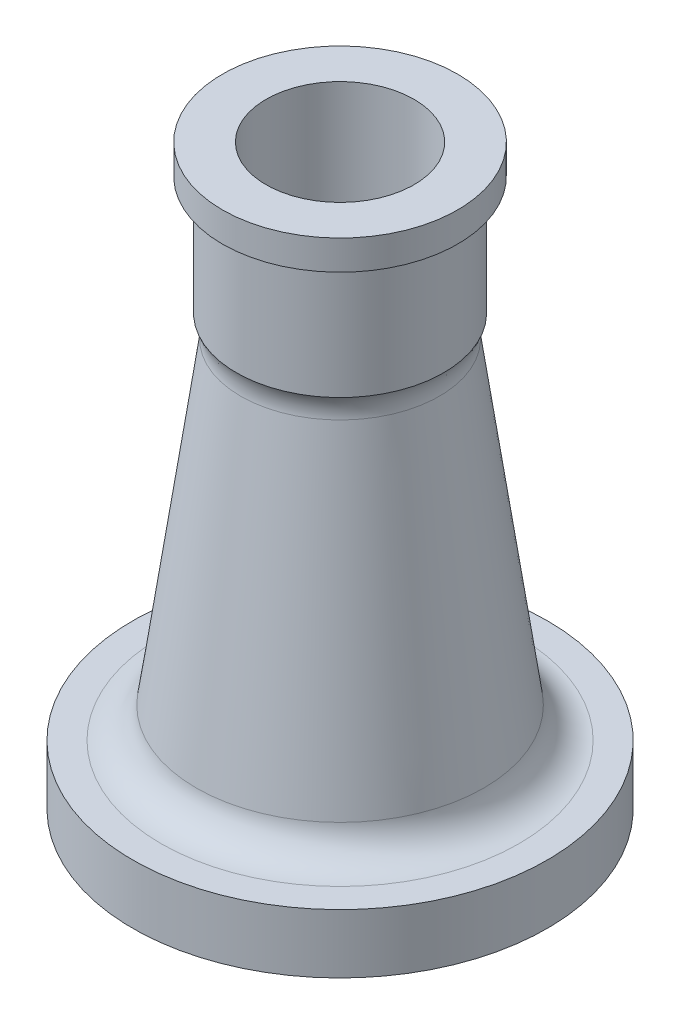
ISO-10303-21;
HEADER;
FILE_DESCRIPTION(('STEP AP214'),'2;1');
FILE_NAME('part.step','',(''),(''),'','','');
FILE_SCHEMA(('AUTOMOTIVE_DESIGN { 1 0 10303 214 1 1 1 1 }'));
ENDSEC;
DATA;
#1=APPLICATION_CONTEXT('core data for automotive mechanical design processes');
#2=APPLICATION_PROTOCOL_DEFINITION('international standard','automotive_design',2000,#1);
#3=PRODUCT_CONTEXT('',#1,'mechanical');
#4=PRODUCT('Part','Part','',(#3));
#5=PRODUCT_RELATED_PRODUCT_CATEGORY('part','',(#4));
#6=PRODUCT_DEFINITION_FORMATION('','',#4);
#7=PRODUCT_DEFINITION_CONTEXT('part definition',#1,'design');
#8=PRODUCT_DEFINITION('design','',#6,#7);
#9=PRODUCT_DEFINITION_SHAPE('','',#8);
#10=(LENGTH_UNIT() NAMED_UNIT(*) SI_UNIT(.MILLI.,.METRE.));
#11=(NAMED_UNIT(*) PLANE_ANGLE_UNIT() SI_UNIT($,.RADIAN.));
#12=(NAMED_UNIT(*) SI_UNIT($,.STERADIAN.) SOLID_ANGLE_UNIT());
#13=UNCERTAINTY_MEASURE_WITH_UNIT(LENGTH_MEASURE(1.E-05),#10,'distance_accuracy_value','');
#14=(GEOMETRIC_REPRESENTATION_CONTEXT(3) GLOBAL_UNCERTAINTY_ASSIGNED_CONTEXT((#13)) GLOBAL_UNIT_ASSIGNED_CONTEXT((#10,
#11,#12)) REPRESENTATION_CONTEXT('',''));
#15=CARTESIAN_POINT('',(0.,0.,0.));
#16=DIRECTION('',(0.,0.,1.));
#17=DIRECTION('',(1.,0.,0.));
#18=AXIS2_PLACEMENT_3D('',#15,#16,#17);
#19=CARTESIAN_POINT('',(0.,-92.5,0.));
#20=DIRECTION('',(0.,-1.,0.));
#21=DIRECTION('',(0.,0.,-1.));
#22=AXIS2_PLACEMENT_3D('',#19,#20,#21);
#23=CYLINDRICAL_SURFACE('',#22,60.);
#24=CARTESIAN_POINT('',(0.,-53.9736308486991,0.));
#25=DIRECTION('',(0.,-1.,0.));
#26=DIRECTION('',(0.,0.,-1.));
#27=AXIS2_PLACEMENT_3D('',#24,#25,#26);
#28=CIRCLE('',#27,60.);
#29=CARTESIAN_POINT('',(0.,-53.9736308486991,-60.));
#30=VERTEX_POINT('',#29);
#31=EDGE_CURVE('E46',#30,#30,#28,.T.);
#32=ORIENTED_EDGE('',*,*,#31,.T.);
#33=EDGE_LOOP('',(#32));
#34=FACE_BOUND('',#33,.T.);
#35=CARTESIAN_POINT('',(0.,-43.9736308486991,0.));
#36=DIRECTION('',(0.,-1.,0.));
#37=DIRECTION('',(0.,0.,-1.));
#38=AXIS2_PLACEMENT_3D('',#35,#36,#37);
#39=CIRCLE('',#38,60.);
#40=CARTESIAN_POINT('',(0.,-43.9736308486991,-60.));
#41=VERTEX_POINT('',#40);
#42=EDGE_CURVE('E81',#41,#41,#39,.T.);
#43=ORIENTED_EDGE('',*,*,#42,.F.);
#44=EDGE_LOOP('',(#43));
#45=FACE_BOUND('',#44,.T.);
#46=ADVANCED_FACE('F31',(#34,#45),#23,.F.);
#47=CARTESIAN_POINT('',(70.,-53.9736308486991,0.));
#48=DIRECTION('',(0.,1.,0.));
#49=DIRECTION('',(0.,0.,1.));
#50=AXIS2_PLACEMENT_3D('',#47,#48,#49);
#51=PLANE('',#50);
#52=ORIENTED_EDGE('',*,*,#31,.F.);
#53=EDGE_LOOP('',(#52));
#54=FACE_BOUND('',#53,.T.);
#55=CARTESIAN_POINT('',(0.,-53.9736308486991,0.));
#56=DIRECTION('',(0.,-1.,0.));
#57=DIRECTION('',(0.,0.,-1.));
#58=AXIS2_PLACEMENT_3D('',#55,#56,#57);
#59=CIRCLE('',#58,70.);
#60=CARTESIAN_POINT('',(0.,-53.9736308486991,-70.));
#61=VERTEX_POINT('',#60);
#62=EDGE_CURVE('E51',#61,#61,#59,.T.);
#63=ORIENTED_EDGE('',*,*,#62,.T.);
#64=EDGE_LOOP('',(#63));
#65=FACE_BOUND('',#64,.T.);
#66=ADVANCED_FACE('F89',(#54,#65),#51,.F.);
#67=CARTESIAN_POINT('',(0.,-92.5,0.));
#68=DIRECTION('',(0.,-1.,0.));
#69=DIRECTION('',(0.,0.,-1.));
#70=AXIS2_PLACEMENT_3D('',#67,#68,#69);
#71=CYLINDRICAL_SURFACE('',#70,70.);
#72=ORIENTED_EDGE('',*,*,#62,.F.);
#73=EDGE_LOOP('',(#72));
#74=FACE_BOUND('',#73,.T.);
#75=CARTESIAN_POINT('',(0.,-33.9736308486991,0.));
#76=DIRECTION('',(0.,-1.,0.));
#77=DIRECTION('',(0.,0.,-1.));
#78=AXIS2_PLACEMENT_3D('',#75,#76,#77);
#79=CIRCLE('',#78,70.);
#80=CARTESIAN_POINT('',(0.,-33.9736308486991,-70.));
#81=VERTEX_POINT('',#80);
#82=EDGE_CURVE('E54',#81,#81,#79,.T.);
#83=ORIENTED_EDGE('',*,*,#82,.T.);
#84=EDGE_LOOP('',(#83));
#85=FACE_BOUND('',#84,.T.);
#86=ADVANCED_FACE('F95',(#74,#85),#71,.T.);
#87=CARTESIAN_POINT('',(50.,-33.9736308486991,0.));
#88=DIRECTION('',(0.,-1.,0.));
#89=DIRECTION('',(0.,0.,-1.));
#90=AXIS2_PLACEMENT_3D('',#87,#88,#89);
#91=PLANE('',#90);
#92=CARTESIAN_POINT('',(0.,-33.9736308486991,0.));
#93=DIRECTION('',(0.,-1.,0.));
#94=DIRECTION('',(0.,0.,-1.));
#95=AXIS2_PLACEMENT_3D('',#92,#93,#94);
#96=CIRCLE('',#95,60.4370293389098);
#97=CARTESIAN_POINT('',(0.,-33.9736308486991,-60.4370293389098));
#98=VERTEX_POINT('',#97);
#99=EDGE_CURVE('E38',#98,#98,#96,.T.);
#100=ORIENTED_EDGE('',*,*,#99,.T.);
#101=EDGE_LOOP('',(#100));
#102=FACE_BOUND('',#101,.T.);
#103=ORIENTED_EDGE('',*,*,#82,.F.);
#104=EDGE_LOOP('',(#103));
#105=FACE_BOUND('',#104,.T.);
#106=ADVANCED_FACE('F116',(#102,#105),#91,.F.);
#107=CARTESIAN_POINT('',(0.,91.0263691513009,0.));
#108=DIRECTION('',(0.,-1.,0.));
#109=DIRECTION('',(0.,0.,-1.));
#110=AXIS2_PLACEMENT_3D('',#107,#108,#109);
#111=CONICAL_SURFACE('',#110,32.5,0.139095941482071);
#112=CARTESIAN_POINT('',(0.,-23.637404983112,0.));
#113=DIRECTION('',(0.,-1.,0.));
#114=DIRECTION('',(0.,0.,-1.));
#115=AXIS2_PLACEMENT_3D('',#112,#113,#114);
#116=CIRCLE('',#115,48.5529283788178);
#117=CARTESIAN_POINT('',(0.,-23.637404983112,-48.5529283788178));
#118=VERTEX_POINT('',#117);
#119=EDGE_CURVE('E10',#118,#118,#116,.F.);
#120=ORIENTED_EDGE('',*,*,#119,.T.);
#121=EDGE_LOOP('',(#120));
#122=FACE_BOUND('',#121,.T.);
#123=CARTESIAN_POINT('',(0.,83.4535584418557,0.));
#124=DIRECTION('',(0.,1.,0.));
#125=DIRECTION('',(0.,0.,1.));
#126=AXIS2_PLACEMENT_3D('',#123,#124,#125);
#127=CIRCLE('',#126,33.5601934993223);
#128=CARTESIAN_POINT('',(0.,83.4535584418557,33.5601934993223));
#129=VERTEX_POINT('',#128);
#130=EDGE_CURVE('E42',#129,#129,#127,.F.);
#131=ORIENTED_EDGE('',*,*,#130,.T.);
#132=EDGE_LOOP('',(#131));
#133=FACE_BOUND('',#132,.T.);
#134=ADVANCED_FACE('F113',(#122,#133),#111,.T.);
#135=CARTESIAN_POINT('',(0.,-92.5,0.));
#136=DIRECTION('',(0.,-1.,0.));
#137=DIRECTION('',(0.,0.,-1.));
#138=AXIS2_PLACEMENT_3D('',#135,#136,#137);
#139=CYLINDRICAL_SURFACE('',#138,35.);
#140=CARTESIAN_POINT('',(0.,91.0263691513009,0.));
#141=DIRECTION('',(0.,-1.,0.));
#142=DIRECTION('',(0.,0.,-1.));
#143=AXIS2_PLACEMENT_3D('',#140,#141,#142);
#144=CIRCLE('',#143,35.);
#145=CARTESIAN_POINT('',(0.,91.0263691513009,-35.));
#146=VERTEX_POINT('',#145);
#147=EDGE_CURVE('E57',#146,#146,#144,.T.);
#148=ORIENTED_EDGE('',*,*,#147,.F.);
#149=EDGE_LOOP('',(#148));
#150=FACE_BOUND('',#149,.T.);
#151=CARTESIAN_POINT('',(0.,131.026369151301,0.));
#152=DIRECTION('',(0.,-1.,0.));
#153=DIRECTION('',(0.,0.,-1.));
#154=AXIS2_PLACEMENT_3D('',#151,#152,#153);
#155=CIRCLE('',#154,35.);
#156=CARTESIAN_POINT('',(0.,131.026369151301,-35.));
#157=VERTEX_POINT('',#156);
#158=EDGE_CURVE('E60',#157,#157,#155,.T.);
#159=ORIENTED_EDGE('',*,*,#158,.T.);
#160=EDGE_LOOP('',(#159));
#161=FACE_BOUND('',#160,.T.);
#162=ADVANCED_FACE('F115',(#150,#161),#139,.T.);
#163=CARTESIAN_POINT('',(39.7258953312239,131.026369151301,0.));
#164=DIRECTION('',(0.,1.,0.));
#165=DIRECTION('',(0.,0.,1.));
#166=AXIS2_PLACEMENT_3D('',#163,#164,#165);
#167=PLANE('',#166);
#168=ORIENTED_EDGE('',*,*,#158,.F.);
#169=EDGE_LOOP('',(#168));
#170=FACE_BOUND('',#169,.T.);
#171=CARTESIAN_POINT('',(0.,131.026369151301,0.));
#172=DIRECTION('',(0.,-1.,0.));
#173=DIRECTION('',(0.,0.,-1.));
#174=AXIS2_PLACEMENT_3D('',#171,#172,#173);
#175=CIRCLE('',#174,39.7258953312239);
#176=CARTESIAN_POINT('',(0.,131.026369151301,-39.7258953312239));
#177=VERTEX_POINT('',#176);
#178=EDGE_CURVE('E63',#177,#177,#175,.T.);
#179=ORIENTED_EDGE('',*,*,#178,.T.);
#180=EDGE_LOOP('',(#179));
#181=FACE_BOUND('',#180,.T.);
#182=ADVANCED_FACE('F122',(#170,#181),#167,.F.);
#183=CARTESIAN_POINT('',(0.,-92.5,0.));
#184=DIRECTION('',(0.,-1.,0.));
#185=DIRECTION('',(0.,0.,-1.));
#186=AXIS2_PLACEMENT_3D('',#183,#184,#185);
#187=CYLINDRICAL_SURFACE('',#186,39.7258953312239);
#188=ORIENTED_EDGE('',*,*,#178,.F.);
#189=EDGE_LOOP('',(#188));
#190=FACE_BOUND('',#189,.T.);
#191=CARTESIAN_POINT('',(0.,141.026369151301,0.));
#192=DIRECTION('',(0.,-1.,0.));
#193=DIRECTION('',(0.,0.,-1.));
#194=AXIS2_PLACEMENT_3D('',#191,#192,#193);
#195=CIRCLE('',#194,39.7258953312239);
#196=CARTESIAN_POINT('',(0.,141.026369151301,-39.7258953312239));
#197=VERTEX_POINT('',#196);
#198=EDGE_CURVE('E66',#197,#197,#195,.T.);
#199=ORIENTED_EDGE('',*,*,#198,.T.);
#200=EDGE_LOOP('',(#199));
#201=FACE_BOUND('',#200,.T.);
#202=ADVANCED_FACE('F200',(#190,#201),#187,.T.);
#203=CARTESIAN_POINT('',(39.7258953312239,141.026369151301,0.));
#204=DIRECTION('',(0.,1.,0.));
#205=DIRECTION('',(0.,0.,1.));
#206=AXIS2_PLACEMENT_3D('',#203,#204,#205);
#207=PLANE('',#206);
#208=CARTESIAN_POINT('',(0.,141.026369151301,0.));
#209=DIRECTION('',(0.,-1.,0.));
#210=DIRECTION('',(0.,0.,-1.));
#211=AXIS2_PLACEMENT_3D('',#208,#209,#210);
#212=CIRCLE('',#211,25.);
#213=CARTESIAN_POINT('',(0.,141.026369151301,-25.));
#214=VERTEX_POINT('',#213);
#215=EDGE_CURVE('E69',#214,#214,#212,.T.);
#216=ORIENTED_EDGE('',*,*,#215,.T.);
#217=EDGE_LOOP('',(#216));
#218=FACE_BOUND('',#217,.T.);
#219=ORIENTED_EDGE('',*,*,#198,.F.);
#220=EDGE_LOOP('',(#219));
#221=FACE_BOUND('',#220,.T.);
#222=ADVANCED_FACE('F191',(#218,#221),#207,.T.);
#223=CARTESIAN_POINT('',(0.,-92.5,0.));
#224=DIRECTION('',(0.,-1.,0.));
#225=DIRECTION('',(0.,0.,-1.));
#226=AXIS2_PLACEMENT_3D('',#223,#224,#225);
#227=CYLINDRICAL_SURFACE('',#226,25.);
#228=CARTESIAN_POINT('',(0.,101.026369151301,0.));
#229=DIRECTION('',(0.,-1.,0.));
#230=DIRECTION('',(0.,0.,-1.));
#231=AXIS2_PLACEMENT_3D('',#228,#229,#230);
#232=CIRCLE('',#231,25.);
#233=CARTESIAN_POINT('',(0.,101.026369151301,-25.));
#234=VERTEX_POINT('',#233);
#235=EDGE_CURVE('E72',#234,#234,#232,.T.);
#236=ORIENTED_EDGE('',*,*,#235,.T.);
#237=EDGE_LOOP('',(#236));
#238=FACE_BOUND('',#237,.T.);
#239=ORIENTED_EDGE('',*,*,#215,.F.);
#240=EDGE_LOOP('',(#239));
#241=FACE_BOUND('',#240,.T.);
#242=ADVANCED_FACE('F182',(#238,#241),#227,.F.);
#243=CARTESIAN_POINT('',(35.,101.026369151301,0.));
#244=DIRECTION('',(0.,1.,0.));
#245=DIRECTION('',(0.,0.,1.));
#246=AXIS2_PLACEMENT_3D('',#243,#244,#245);
#247=PLANE('',#246);
#248=CARTESIAN_POINT('',(0.,101.026369151301,0.));
#249=DIRECTION('',(0.,-1.,0.));
#250=DIRECTION('',(0.,0.,-1.));
#251=AXIS2_PLACEMENT_3D('',#248,#249,#250);
#252=CIRCLE('',#251,21.0024755509085);
#253=CARTESIAN_POINT('',(0.,101.026369151301,-21.0024755509085));
#254=VERTEX_POINT('',#253);
#255=EDGE_CURVE('E75',#254,#254,#252,.T.);
#256=ORIENTED_EDGE('',*,*,#255,.T.);
#257=EDGE_LOOP('',(#256));
#258=FACE_BOUND('',#257,.T.);
#259=ORIENTED_EDGE('',*,*,#235,.F.);
#260=EDGE_LOOP('',(#259));
#261=FACE_BOUND('',#260,.T.);
#262=ADVANCED_FACE('F173',(#258,#261),#247,.T.);
#263=CARTESIAN_POINT('',(0.,101.026369151301,0.));
#264=DIRECTION('',(0.,-1.,0.));
#265=DIRECTION('',(0.,0.,-1.));
#266=AXIS2_PLACEMENT_3D('',#263,#264,#265);
#267=CONICAL_SURFACE('',#266,21.0024755509085,0.139095941482071);
#268=CARTESIAN_POINT('',(0.,-43.9736308486991,0.));
#269=DIRECTION('',(0.,-1.,0.));
#270=DIRECTION('',(0.,0.,-1.));
#271=AXIS2_PLACEMENT_3D('',#268,#269,#270);
#272=CIRCLE('',#271,41.3024755509085);
#273=CARTESIAN_POINT('',(0.,-43.9736308486991,-41.3024755509085));
#274=VERTEX_POINT('',#273);
#275=EDGE_CURVE('E78',#274,#274,#272,.T.);
#276=ORIENTED_EDGE('',*,*,#275,.T.);
#277=EDGE_LOOP('',(#276));
#278=FACE_BOUND('',#277,.T.);
#279=ORIENTED_EDGE('',*,*,#255,.F.);
#280=EDGE_LOOP('',(#279));
#281=FACE_BOUND('',#280,.T.);
#282=ADVANCED_FACE('F107',(#278,#281),#267,.F.);
#283=CARTESIAN_POINT('',(50.,-43.9736308486991,0.));
#284=DIRECTION('',(0.,-1.,0.));
#285=DIRECTION('',(0.,0.,-1.));
#286=AXIS2_PLACEMENT_3D('',#283,#284,#285);
#287=PLANE('',#286);
#288=ORIENTED_EDGE('',*,*,#42,.T.);
#289=EDGE_LOOP('',(#288));
#290=FACE_BOUND('',#289,.T.);
#291=ORIENTED_EDGE('',*,*,#275,.F.);
#292=EDGE_LOOP('',(#291));
#293=FACE_BOUND('',#292,.T.);
#294=ADVANCED_FACE('F85',(#290,#293),#287,.T.);
#295=CARTESIAN_POINT('',(0.,85.1173325762686,0.));
#296=DIRECTION('',(0.,1.,0.));
#297=DIRECTION('',(0.,0.,1.));
#298=AXIS2_PLACEMENT_3D('',#295,#296,#297);
#299=TOROIDAL_SURFACE('',#298,45.4442944594143,12.);
#300=ORIENTED_EDGE('',*,*,#147,.T.);
#301=EDGE_LOOP('',(#300));
#302=FACE_BOUND('',#301,.T.);
#303=ORIENTED_EDGE('',*,*,#130,.F.);
#304=EDGE_LOOP('',(#303));
#305=FACE_BOUND('',#304,.T.);
#306=ADVANCED_FACE('F99',(#302,#305),#299,.F.);
#307=CARTESIAN_POINT('',(0.,-21.9736308486991,0.));
#308=DIRECTION('',(0.,-1.,0.));
#309=DIRECTION('',(0.,0.,-1.));
#310=AXIS2_PLACEMENT_3D('',#307,#308,#309);
#311=TOROIDAL_SURFACE('',#310,60.4370293389098,12.);
#312=ORIENTED_EDGE('',*,*,#119,.F.);
#313=EDGE_LOOP('',(#312));
#314=FACE_BOUND('',#313,.T.);
#315=ORIENTED_EDGE('',*,*,#99,.F.);
#316=EDGE_LOOP('',(#315));
#317=FACE_BOUND('',#316,.T.);
#318=ADVANCED_FACE('F33',(#314,#317),#311,.F.);
#319=CLOSED_SHELL('',(#46,#66,#86,#106,#134,#162,#182,#202,#222,#242,#262,#282,#294,#306,#318));
#320=MANIFOLD_SOLID_BREP('B2',#319);
#321=ADVANCED_BREP_SHAPE_REPRESENTATION('',(#18,#320),#14);
#322=SHAPE_DEFINITION_REPRESENTATION(#9,#321);
ENDSEC;
END-ISO-10303-21;
